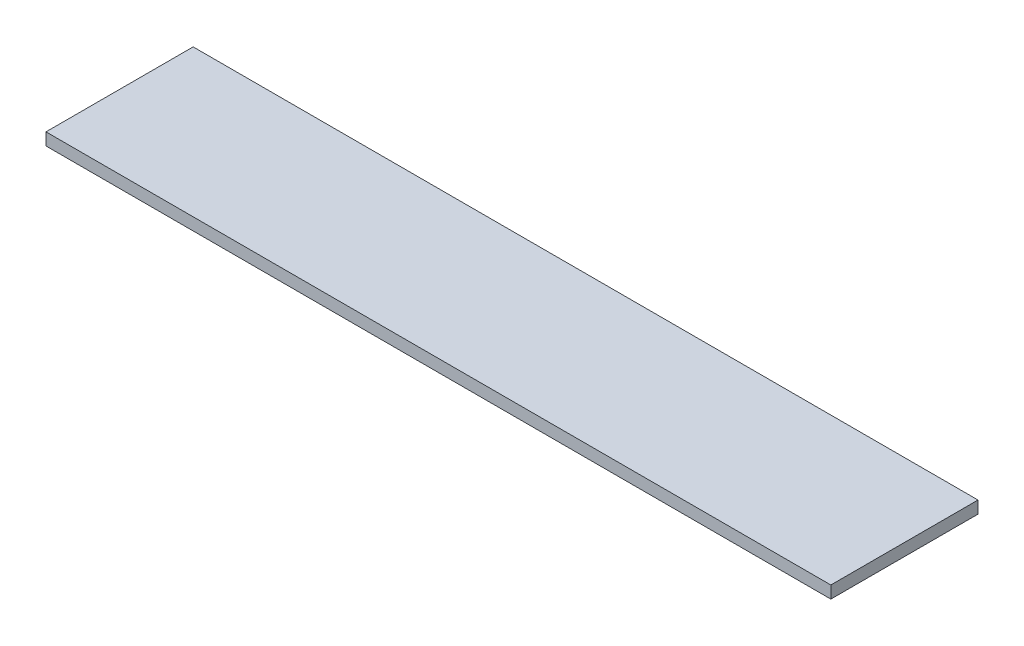
ISO-10303-21;
HEADER;
FILE_DESCRIPTION(('STEP AP214'),'2;1');
FILE_NAME('part.step','',(''),(''),'','','');
FILE_SCHEMA(('AUTOMOTIVE_DESIGN { 1 0 10303 214 1 1 1 1 }'));
ENDSEC;
DATA;
#1=APPLICATION_CONTEXT('core data for automotive mechanical design processes');
#2=APPLICATION_PROTOCOL_DEFINITION('international standard','automotive_design',2000,#1);
#3=PRODUCT_CONTEXT('',#1,'mechanical');
#4=PRODUCT('Part','Part','',(#3));
#5=PRODUCT_RELATED_PRODUCT_CATEGORY('part','',(#4));
#6=PRODUCT_DEFINITION_FORMATION('','',#4);
#7=PRODUCT_DEFINITION_CONTEXT('part definition',#1,'design');
#8=PRODUCT_DEFINITION('design','',#6,#7);
#9=PRODUCT_DEFINITION_SHAPE('','',#8);
#10=(LENGTH_UNIT() NAMED_UNIT(*) SI_UNIT(.MILLI.,.METRE.));
#11=(NAMED_UNIT(*) PLANE_ANGLE_UNIT() SI_UNIT($,.RADIAN.));
#12=(NAMED_UNIT(*) SI_UNIT($,.STERADIAN.) SOLID_ANGLE_UNIT());
#13=UNCERTAINTY_MEASURE_WITH_UNIT(LENGTH_MEASURE(1.E-05),#10,'distance_accuracy_value','');
#14=(GEOMETRIC_REPRESENTATION_CONTEXT(3) GLOBAL_UNCERTAINTY_ASSIGNED_CONTEXT((#13)) GLOBAL_UNIT_ASSIGNED_CONTEXT((#10,
#11,#12)) REPRESENTATION_CONTEXT('',''));
#15=CARTESIAN_POINT('',(0.,0.,0.));
#16=DIRECTION('',(0.,0.,1.));
#17=DIRECTION('',(1.,0.,0.));
#18=AXIS2_PLACEMENT_3D('',#15,#16,#17);
#19=CARTESIAN_POINT('',(0.,6.35,0.));
#20=DIRECTION('',(1.,0.,0.));
#21=DIRECTION('',(0.,0.,1.));
#22=AXIS2_PLACEMENT_3D('',#19,#20,#21);
#23=PLANE('',#22);
#24=DIRECTION('',(0.,0.,-1.));
#25=VECTOR('',#24,1.);
#26=CARTESIAN_POINT('',(0.,0.,0.));
#27=LINE('',#26,#25);
#28=CARTESIAN_POINT('',(0.,0.,76.2));
#29=VERTEX_POINT('',#28);
#30=CARTESIAN_POINT('',(0.,0.,0.));
#31=VERTEX_POINT('',#30);
#32=EDGE_CURVE('E98',#29,#31,#27,.T.);
#33=ORIENTED_EDGE('',*,*,#32,.F.);
#34=DIRECTION('',(0.,-1.,0.));
#35=VECTOR('',#34,1.);
#36=CARTESIAN_POINT('',(0.,6.35,76.2));
#37=LINE('',#36,#35);
#38=CARTESIAN_POINT('',(0.,6.35,76.2));
#39=VERTEX_POINT('',#38);
#40=EDGE_CURVE('E97',#39,#29,#37,.T.);
#41=ORIENTED_EDGE('',*,*,#40,.F.);
#42=DIRECTION('',(0.,0.,-1.));
#43=VECTOR('',#42,1.);
#44=CARTESIAN_POINT('',(0.,6.35,0.));
#45=LINE('',#44,#43);
#46=CARTESIAN_POINT('',(0.,6.35,0.));
#47=VERTEX_POINT('',#46);
#48=EDGE_CURVE('E92',#39,#47,#45,.T.);
#49=ORIENTED_EDGE('',*,*,#48,.T.);
#50=DIRECTION('',(0.,-1.,0.));
#51=VECTOR('',#50,1.);
#52=CARTESIAN_POINT('',(0.,6.35,0.));
#53=LINE('',#52,#51);
#54=EDGE_CURVE('E11',#47,#31,#53,.T.);
#55=ORIENTED_EDGE('',*,*,#54,.T.);
#56=EDGE_LOOP('',(#33,#41,#49,#55));
#57=FACE_BOUND('',#56,.T.);
#58=ADVANCED_FACE('F35',(#57),#23,.F.);
#59=CARTESIAN_POINT('',(0.,6.35,0.));
#60=DIRECTION('',(0.,0.,1.));
#61=DIRECTION('',(-1.,0.,0.));
#62=AXIS2_PLACEMENT_3D('',#59,#60,#61);
#63=PLANE('',#62);
#64=DIRECTION('',(1.,0.,0.));
#65=VECTOR('',#64,1.);
#66=CARTESIAN_POINT('',(0.,0.,0.));
#67=LINE('',#66,#65);
#68=CARTESIAN_POINT('',(406.4,0.,0.));
#69=VERTEX_POINT('',#68);
#70=EDGE_CURVE('E100',#31,#69,#67,.T.);
#71=ORIENTED_EDGE('',*,*,#70,.F.);
#72=ORIENTED_EDGE('',*,*,#54,.F.);
#73=DIRECTION('',(1.,0.,0.));
#74=VECTOR('',#73,1.);
#75=CARTESIAN_POINT('',(0.,6.35,0.));
#76=LINE('',#75,#74);
#77=CARTESIAN_POINT('',(406.4,6.35,0.));
#78=VERTEX_POINT('',#77);
#79=EDGE_CURVE('E76',#47,#78,#76,.T.);
#80=ORIENTED_EDGE('',*,*,#79,.T.);
#81=DIRECTION('',(0.,-1.,0.));
#82=VECTOR('',#81,1.);
#83=CARTESIAN_POINT('',(406.4,6.35,0.));
#84=LINE('',#83,#82);
#85=EDGE_CURVE('E43',#78,#69,#84,.T.);
#86=ORIENTED_EDGE('',*,*,#85,.T.);
#87=EDGE_LOOP('',(#71,#72,#80,#86));
#88=FACE_BOUND('',#87,.T.);
#89=ADVANCED_FACE('F90',(#88),#63,.F.);
#90=CARTESIAN_POINT('',(406.4,6.35,0.));
#91=DIRECTION('',(-1.,0.,0.));
#92=DIRECTION('',(0.,0.,-1.));
#93=AXIS2_PLACEMENT_3D('',#90,#91,#92);
#94=PLANE('',#93);
#95=DIRECTION('',(0.,0.,1.));
#96=VECTOR('',#95,1.);
#97=CARTESIAN_POINT('',(406.4,0.,0.));
#98=LINE('',#97,#96);
#99=CARTESIAN_POINT('',(406.4,0.,76.2));
#100=VERTEX_POINT('',#99);
#101=EDGE_CURVE('E86',#69,#100,#98,.T.);
#102=ORIENTED_EDGE('',*,*,#101,.F.);
#103=ORIENTED_EDGE('',*,*,#85,.F.);
#104=DIRECTION('',(0.,0.,1.));
#105=VECTOR('',#104,1.);
#106=CARTESIAN_POINT('',(406.4,6.35,0.));
#107=LINE('',#106,#105);
#108=CARTESIAN_POINT('',(406.4,6.35,76.2));
#109=VERTEX_POINT('',#108);
#110=EDGE_CURVE('E79',#78,#109,#107,.T.);
#111=ORIENTED_EDGE('',*,*,#110,.T.);
#112=DIRECTION('',(0.,-1.,0.));
#113=VECTOR('',#112,1.);
#114=CARTESIAN_POINT('',(406.4,6.35,76.2));
#115=LINE('',#114,#113);
#116=EDGE_CURVE('E89',#109,#100,#115,.T.);
#117=ORIENTED_EDGE('',*,*,#116,.T.);
#118=EDGE_LOOP('',(#102,#103,#111,#117));
#119=FACE_BOUND('',#118,.T.);
#120=ADVANCED_FACE('F85',(#119),#94,.F.);
#121=CARTESIAN_POINT('',(0.,6.35,76.2));
#122=DIRECTION('',(0.,0.,-1.));
#123=DIRECTION('',(1.,0.,0.));
#124=AXIS2_PLACEMENT_3D('',#121,#122,#123);
#125=PLANE('',#124);
#126=DIRECTION('',(-1.,0.,0.));
#127=VECTOR('',#126,1.);
#128=CARTESIAN_POINT('',(0.,0.,76.2));
#129=LINE('',#128,#127);
#130=EDGE_CURVE('E65',#100,#29,#129,.T.);
#131=ORIENTED_EDGE('',*,*,#130,.F.);
#132=ORIENTED_EDGE('',*,*,#116,.F.);
#133=DIRECTION('',(-1.,0.,0.));
#134=VECTOR('',#133,1.);
#135=CARTESIAN_POINT('',(0.,6.35,76.2));
#136=LINE('',#135,#134);
#137=EDGE_CURVE('E51',#109,#39,#136,.T.);
#138=ORIENTED_EDGE('',*,*,#137,.T.);
#139=ORIENTED_EDGE('',*,*,#40,.T.);
#140=EDGE_LOOP('',(#131,#132,#138,#139));
#141=FACE_BOUND('',#140,.T.);
#142=ADVANCED_FACE('F109',(#141),#125,.F.);
#143=CARTESIAN_POINT('',(0.,6.35,0.));
#144=DIRECTION('',(0.,-1.,0.));
#145=DIRECTION('',(0.,0.,1.));
#146=AXIS2_PLACEMENT_3D('',#143,#144,#145);
#147=PLANE('',#146);
#148=ORIENTED_EDGE('',*,*,#48,.F.);
#149=ORIENTED_EDGE('',*,*,#137,.F.);
#150=ORIENTED_EDGE('',*,*,#110,.F.);
#151=ORIENTED_EDGE('',*,*,#79,.F.);
#152=EDGE_LOOP('',(#148,#149,#150,#151));
#153=FACE_BOUND('',#152,.T.);
#154=ADVANCED_FACE('F81',(#153),#147,.F.);
#155=CARTESIAN_POINT('',(0.,0.,0.));
#156=DIRECTION('',(0.,-1.,0.));
#157=DIRECTION('',(0.,0.,1.));
#158=AXIS2_PLACEMENT_3D('',#155,#156,#157);
#159=PLANE('',#158);
#160=ORIENTED_EDGE('',*,*,#32,.T.);
#161=ORIENTED_EDGE('',*,*,#70,.T.);
#162=ORIENTED_EDGE('',*,*,#101,.T.);
#163=ORIENTED_EDGE('',*,*,#130,.T.);
#164=EDGE_LOOP('',(#160,#161,#162,#163));
#165=FACE_BOUND('',#164,.T.);
#166=ADVANCED_FACE('F105',(#165),#159,.T.);
#167=CLOSED_SHELL('',(#58,#89,#120,#142,#154,#166));
#168=MANIFOLD_SOLID_BREP('B2',#167);
#169=ADVANCED_BREP_SHAPE_REPRESENTATION('',(#18,#168),#14);
#170=SHAPE_DEFINITION_REPRESENTATION(#9,#169);
ENDSEC;
END-ISO-10303-21;
